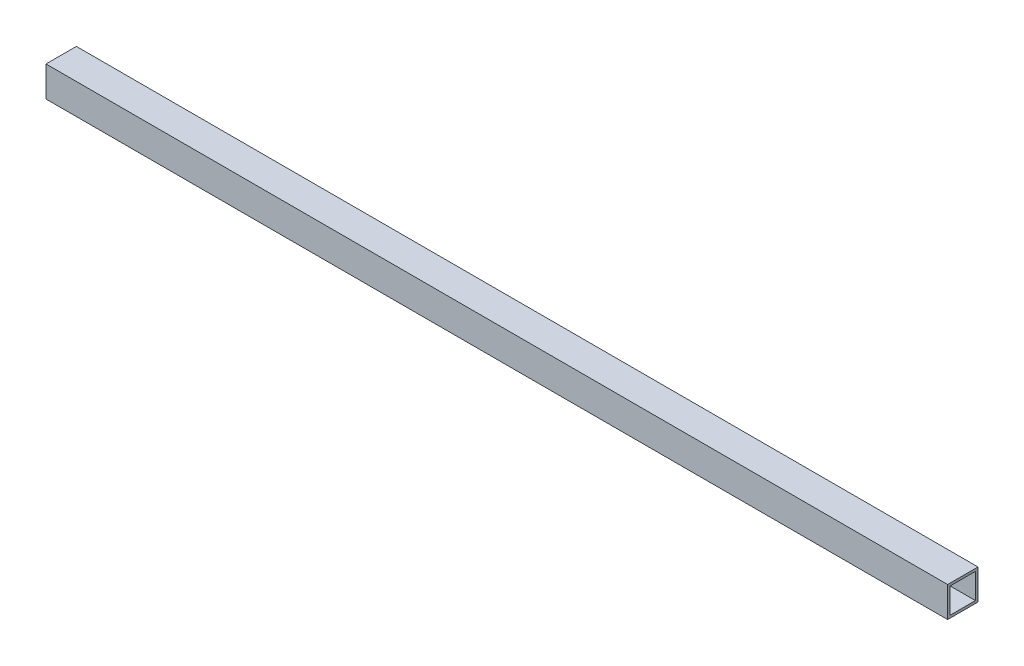
ISO-10303-21;
HEADER;
FILE_DESCRIPTION(('STEP AP214'),'2;1');
FILE_NAME('part.step','',(''),(''),'','','');
FILE_SCHEMA(('AUTOMOTIVE_DESIGN { 1 0 10303 214 1 1 1 1 }'));
ENDSEC;
DATA;
#1=APPLICATION_CONTEXT('core data for automotive mechanical design processes');
#2=APPLICATION_PROTOCOL_DEFINITION('international standard','automotive_design',2000,#1);
#3=PRODUCT_CONTEXT('',#1,'mechanical');
#4=PRODUCT('Part','Part','',(#3));
#5=PRODUCT_RELATED_PRODUCT_CATEGORY('part','',(#4));
#6=PRODUCT_DEFINITION_FORMATION('','',#4);
#7=PRODUCT_DEFINITION_CONTEXT('part definition',#1,'design');
#8=PRODUCT_DEFINITION('design','',#6,#7);
#9=PRODUCT_DEFINITION_SHAPE('','',#8);
#10=(LENGTH_UNIT() NAMED_UNIT(*) SI_UNIT(.MILLI.,.METRE.));
#11=(NAMED_UNIT(*) PLANE_ANGLE_UNIT() SI_UNIT($,.RADIAN.));
#12=(NAMED_UNIT(*) SI_UNIT($,.STERADIAN.) SOLID_ANGLE_UNIT());
#13=UNCERTAINTY_MEASURE_WITH_UNIT(LENGTH_MEASURE(1.E-05),#10,'distance_accuracy_value','');
#14=(GEOMETRIC_REPRESENTATION_CONTEXT(3) GLOBAL_UNCERTAINTY_ASSIGNED_CONTEXT((#13)) GLOBAL_UNIT_ASSIGNED_CONTEXT((#10,
#11,#12)) REPRESENTATION_CONTEXT('',''));
#15=CARTESIAN_POINT('',(0.,0.,0.));
#16=DIRECTION('',(0.,0.,1.));
#17=DIRECTION('',(1.,0.,0.));
#18=AXIS2_PLACEMENT_3D('',#15,#16,#17);
#19=CARTESIAN_POINT('',(282.575,0.,0.));
#20=DIRECTION('',(-1.,0.,0.));
#21=DIRECTION('',(0.,0.,1.));
#22=AXIS2_PLACEMENT_3D('',#19,#20,#21);
#23=PLANE('',#22);
#24=DIRECTION('',(0.,-1.,0.));
#25=VECTOR('',#24,1.);
#26=CARTESIAN_POINT('',(282.575,9.525,9.525));
#27=LINE('',#26,#25);
#28=CARTESIAN_POINT('',(282.575,9.525,9.525));
#29=VERTEX_POINT('',#28);
#30=CARTESIAN_POINT('',(282.575,-9.525,9.525));
#31=VERTEX_POINT('',#30);
#32=EDGE_CURVE('E138',#29,#31,#27,.T.);
#33=ORIENTED_EDGE('',*,*,#32,.T.);
#34=DIRECTION('',(0.,0.,-1.));
#35=VECTOR('',#34,1.);
#36=CARTESIAN_POINT('',(282.575,-9.525,-9.525));
#37=LINE('',#36,#35);
#38=CARTESIAN_POINT('',(282.575,-9.525,-9.525));
#39=VERTEX_POINT('',#38);
#40=EDGE_CURVE('E141',#31,#39,#37,.T.);
#41=ORIENTED_EDGE('',*,*,#40,.T.);
#42=DIRECTION('',(0.,1.,0.));
#43=VECTOR('',#42,1.);
#44=CARTESIAN_POINT('',(282.575,9.525,-9.525));
#45=LINE('',#44,#43);
#46=CARTESIAN_POINT('',(282.575,9.525,-9.525));
#47=VERTEX_POINT('',#46);
#48=EDGE_CURVE('E144',#39,#47,#45,.T.);
#49=ORIENTED_EDGE('',*,*,#48,.T.);
#50=DIRECTION('',(0.,0.,1.));
#51=VECTOR('',#50,1.);
#52=CARTESIAN_POINT('',(282.575,9.525,-9.525));
#53=LINE('',#52,#51);
#54=EDGE_CURVE('E146',#47,#29,#53,.T.);
#55=ORIENTED_EDGE('',*,*,#54,.T.);
#56=EDGE_LOOP('',(#33,#41,#49,#55));
#57=FACE_BOUND('',#56,.T.);
#58=DIRECTION('',(0.,0.,1.));
#59=VECTOR('',#58,1.);
#60=CARTESIAN_POINT('',(282.575,7.9375,-7.9375));
#61=LINE('',#60,#59);
#62=CARTESIAN_POINT('',(282.575,7.9375,-7.9375));
#63=VERTEX_POINT('',#62);
#64=CARTESIAN_POINT('',(282.575,7.9375,7.9375));
#65=VERTEX_POINT('',#64);
#66=EDGE_CURVE('E102',#63,#65,#61,.T.);
#67=ORIENTED_EDGE('',*,*,#66,.F.);
#68=DIRECTION('',(0.,1.,0.));
#69=VECTOR('',#68,1.);
#70=CARTESIAN_POINT('',(282.575,7.9375,-7.9375));
#71=LINE('',#70,#69);
#72=CARTESIAN_POINT('',(282.575,-7.9375,-7.9375));
#73=VERTEX_POINT('',#72);
#74=EDGE_CURVE('E124',#73,#63,#71,.T.);
#75=ORIENTED_EDGE('',*,*,#74,.F.);
#76=DIRECTION('',(0.,0.,-1.));
#77=VECTOR('',#76,1.);
#78=CARTESIAN_POINT('',(282.575,-7.9375,-7.9375));
#79=LINE('',#78,#77);
#80=CARTESIAN_POINT('',(282.575,-7.9375,7.93749999999999));
#81=VERTEX_POINT('',#80);
#82=EDGE_CURVE('E122',#81,#73,#79,.T.);
#83=ORIENTED_EDGE('',*,*,#82,.F.);
#84=DIRECTION('',(0.,-1.,0.));
#85=VECTOR('',#84,1.);
#86=CARTESIAN_POINT('',(282.575,7.9375,7.9375));
#87=LINE('',#86,#85);
#88=EDGE_CURVE('E110',#65,#81,#87,.T.);
#89=ORIENTED_EDGE('',*,*,#88,.F.);
#90=EDGE_LOOP('',(#67,#75,#83,#89));
#91=FACE_BOUND('',#90,.T.);
#92=ADVANCED_FACE('F37',(#57,#91),#23,.F.);
#93=CARTESIAN_POINT('',(-282.575,0.,0.));
#94=DIRECTION('',(-1.,0.,0.));
#95=DIRECTION('',(0.,0.,1.));
#96=AXIS2_PLACEMENT_3D('',#93,#94,#95);
#97=PLANE('',#96);
#98=DIRECTION('',(0.,-1.,0.));
#99=VECTOR('',#98,1.);
#100=CARTESIAN_POINT('',(-282.575,9.525,9.525));
#101=LINE('',#100,#99);
#102=CARTESIAN_POINT('',(-282.575,9.525,9.525));
#103=VERTEX_POINT('',#102);
#104=CARTESIAN_POINT('',(-282.575,-9.525,9.525));
#105=VERTEX_POINT('',#104);
#106=EDGE_CURVE('E118',#103,#105,#101,.T.);
#107=ORIENTED_EDGE('',*,*,#106,.F.);
#108=DIRECTION('',(0.,0.,1.));
#109=VECTOR('',#108,1.);
#110=CARTESIAN_POINT('',(-282.575,9.525,-9.525));
#111=LINE('',#110,#109);
#112=CARTESIAN_POINT('',(-282.575,9.525,-9.525));
#113=VERTEX_POINT('',#112);
#114=EDGE_CURVE('E142',#113,#103,#111,.T.);
#115=ORIENTED_EDGE('',*,*,#114,.F.);
#116=DIRECTION('',(0.,1.,0.));
#117=VECTOR('',#116,1.);
#118=CARTESIAN_POINT('',(-282.575,9.525,-9.525));
#119=LINE('',#118,#117);
#120=CARTESIAN_POINT('',(-282.575,-9.525,-9.525));
#121=VERTEX_POINT('',#120);
#122=EDGE_CURVE('E153',#121,#113,#119,.T.);
#123=ORIENTED_EDGE('',*,*,#122,.F.);
#124=DIRECTION('',(0.,0.,-1.));
#125=VECTOR('',#124,1.);
#126=CARTESIAN_POINT('',(-282.575,-9.525,-9.525));
#127=LINE('',#126,#125);
#128=EDGE_CURVE('E151',#105,#121,#127,.T.);
#129=ORIENTED_EDGE('',*,*,#128,.F.);
#130=EDGE_LOOP('',(#107,#115,#123,#129));
#131=FACE_BOUND('',#130,.T.);
#132=DIRECTION('',(0.,1.,0.));
#133=VECTOR('',#132,1.);
#134=CARTESIAN_POINT('',(-282.575,7.9375,-7.9375));
#135=LINE('',#134,#133);
#136=CARTESIAN_POINT('',(-282.575,-7.9375,-7.9375));
#137=VERTEX_POINT('',#136);
#138=CARTESIAN_POINT('',(-282.575,7.9375,-7.9375));
#139=VERTEX_POINT('',#138);
#140=EDGE_CURVE('E111',#137,#139,#135,.T.);
#141=ORIENTED_EDGE('',*,*,#140,.T.);
#142=DIRECTION('',(0.,0.,1.));
#143=VECTOR('',#142,1.);
#144=CARTESIAN_POINT('',(-282.575,7.9375,-7.9375));
#145=LINE('',#144,#143);
#146=CARTESIAN_POINT('',(-282.575,7.9375,7.9375));
#147=VERTEX_POINT('',#146);
#148=EDGE_CURVE('E60',#139,#147,#145,.T.);
#149=ORIENTED_EDGE('',*,*,#148,.T.);
#150=DIRECTION('',(0.,-1.,0.));
#151=VECTOR('',#150,1.);
#152=CARTESIAN_POINT('',(-282.575,7.9375,7.9375));
#153=LINE('',#152,#151);
#154=CARTESIAN_POINT('',(-282.575,-7.9375,7.93749999999999));
#155=VERTEX_POINT('',#154);
#156=EDGE_CURVE('E117',#147,#155,#153,.T.);
#157=ORIENTED_EDGE('',*,*,#156,.T.);
#158=DIRECTION('',(0.,0.,-1.));
#159=VECTOR('',#158,1.);
#160=CARTESIAN_POINT('',(-282.575,-7.9375,-7.9375));
#161=LINE('',#160,#159);
#162=EDGE_CURVE('E130',#155,#137,#161,.T.);
#163=ORIENTED_EDGE('',*,*,#162,.T.);
#164=EDGE_LOOP('',(#141,#149,#157,#163));
#165=FACE_BOUND('',#164,.T.);
#166=ADVANCED_FACE('F171',(#131,#165),#97,.T.);
#167=CARTESIAN_POINT('',(282.575,9.525,9.525));
#168=DIRECTION('',(0.,0.,-1.));
#169=DIRECTION('',(-1.,0.,0.));
#170=AXIS2_PLACEMENT_3D('',#167,#168,#169);
#171=PLANE('',#170);
#172=ORIENTED_EDGE('',*,*,#106,.T.);
#173=DIRECTION('',(-1.,0.,0.));
#174=VECTOR('',#173,1.);
#175=CARTESIAN_POINT('',(282.575,-9.525,9.525));
#176=LINE('',#175,#174);
#177=EDGE_CURVE('E11',#31,#105,#176,.T.);
#178=ORIENTED_EDGE('',*,*,#177,.F.);
#179=ORIENTED_EDGE('',*,*,#32,.F.);
#180=DIRECTION('',(-1.,0.,0.));
#181=VECTOR('',#180,1.);
#182=CARTESIAN_POINT('',(282.575,9.525,9.525));
#183=LINE('',#182,#181);
#184=EDGE_CURVE('E148',#29,#103,#183,.T.);
#185=ORIENTED_EDGE('',*,*,#184,.T.);
#186=EDGE_LOOP('',(#172,#178,#179,#185));
#187=FACE_BOUND('',#186,.T.);
#188=ADVANCED_FACE('F39',(#187),#171,.F.);
#189=CARTESIAN_POINT('',(282.575,-9.525,-9.525));
#190=DIRECTION('',(0.,1.,0.));
#191=DIRECTION('',(0.,0.,1.));
#192=AXIS2_PLACEMENT_3D('',#189,#190,#191);
#193=PLANE('',#192);
#194=ORIENTED_EDGE('',*,*,#128,.T.);
#195=DIRECTION('',(-1.,0.,0.));
#196=VECTOR('',#195,1.);
#197=CARTESIAN_POINT('',(282.575,-9.525,-9.525));
#198=LINE('',#197,#196);
#199=EDGE_CURVE('E45',#39,#121,#198,.T.);
#200=ORIENTED_EDGE('',*,*,#199,.F.);
#201=ORIENTED_EDGE('',*,*,#40,.F.);
#202=ORIENTED_EDGE('',*,*,#177,.T.);
#203=EDGE_LOOP('',(#194,#200,#201,#202));
#204=FACE_BOUND('',#203,.T.);
#205=ADVANCED_FACE('F181',(#204),#193,.F.);
#206=CARTESIAN_POINT('',(282.575,9.525,-9.525));
#207=DIRECTION('',(0.,0.,1.));
#208=DIRECTION('',(0.,-1.,0.));
#209=AXIS2_PLACEMENT_3D('',#206,#207,#208);
#210=PLANE('',#209);
#211=ORIENTED_EDGE('',*,*,#122,.T.);
#212=DIRECTION('',(-1.,0.,0.));
#213=VECTOR('',#212,1.);
#214=CARTESIAN_POINT('',(282.575,9.525,-9.525));
#215=LINE('',#214,#213);
#216=EDGE_CURVE('E158',#47,#113,#215,.T.);
#217=ORIENTED_EDGE('',*,*,#216,.F.);
#218=ORIENTED_EDGE('',*,*,#48,.F.);
#219=ORIENTED_EDGE('',*,*,#199,.T.);
#220=EDGE_LOOP('',(#211,#217,#218,#219));
#221=FACE_BOUND('',#220,.T.);
#222=ADVANCED_FACE('F165',(#221),#210,.F.);
#223=CARTESIAN_POINT('',(282.575,9.525,-9.525));
#224=DIRECTION('',(0.,-1.,0.));
#225=DIRECTION('',(0.,0.,-1.));
#226=AXIS2_PLACEMENT_3D('',#223,#224,#225);
#227=PLANE('',#226);
#228=ORIENTED_EDGE('',*,*,#114,.T.);
#229=ORIENTED_EDGE('',*,*,#184,.F.);
#230=ORIENTED_EDGE('',*,*,#54,.F.);
#231=ORIENTED_EDGE('',*,*,#216,.T.);
#232=EDGE_LOOP('',(#228,#229,#230,#231));
#233=FACE_BOUND('',#232,.T.);
#234=ADVANCED_FACE('F175',(#233),#227,.F.);
#235=CARTESIAN_POINT('',(282.575,7.9375,-7.9375));
#236=DIRECTION('',(0.,-1.,0.));
#237=DIRECTION('',(0.,0.,-1.));
#238=AXIS2_PLACEMENT_3D('',#235,#236,#237);
#239=PLANE('',#238);
#240=ORIENTED_EDGE('',*,*,#148,.F.);
#241=DIRECTION('',(-1.,0.,0.));
#242=VECTOR('',#241,1.);
#243=CARTESIAN_POINT('',(282.575,7.9375,-7.9375));
#244=LINE('',#243,#242);
#245=EDGE_CURVE('E106',#63,#139,#244,.T.);
#246=ORIENTED_EDGE('',*,*,#245,.F.);
#247=ORIENTED_EDGE('',*,*,#66,.T.);
#248=DIRECTION('',(-1.,0.,0.));
#249=VECTOR('',#248,1.);
#250=CARTESIAN_POINT('',(282.575,7.9375,7.9375));
#251=LINE('',#250,#249);
#252=EDGE_CURVE('E105',#65,#147,#251,.T.);
#253=ORIENTED_EDGE('',*,*,#252,.T.);
#254=EDGE_LOOP('',(#240,#246,#247,#253));
#255=FACE_BOUND('',#254,.T.);
#256=ADVANCED_FACE('F104',(#255),#239,.T.);
#257=CARTESIAN_POINT('',(282.575,7.9375,7.9375));
#258=DIRECTION('',(0.,0.,-1.));
#259=DIRECTION('',(0.,1.,0.));
#260=AXIS2_PLACEMENT_3D('',#257,#258,#259);
#261=PLANE('',#260);
#262=ORIENTED_EDGE('',*,*,#156,.F.);
#263=ORIENTED_EDGE('',*,*,#252,.F.);
#264=ORIENTED_EDGE('',*,*,#88,.T.);
#265=DIRECTION('',(-1.,0.,0.));
#266=VECTOR('',#265,1.);
#267=CARTESIAN_POINT('',(282.575,-7.9375,7.93749999999999));
#268=LINE('',#267,#266);
#269=EDGE_CURVE('E119',#81,#155,#268,.T.);
#270=ORIENTED_EDGE('',*,*,#269,.T.);
#271=EDGE_LOOP('',(#262,#263,#264,#270));
#272=FACE_BOUND('',#271,.T.);
#273=ADVANCED_FACE('F114',(#272),#261,.T.);
#274=CARTESIAN_POINT('',(282.575,-7.9375,-7.9375));
#275=DIRECTION('',(0.,1.,0.));
#276=DIRECTION('',(0.,0.,1.));
#277=AXIS2_PLACEMENT_3D('',#274,#275,#276);
#278=PLANE('',#277);
#279=ORIENTED_EDGE('',*,*,#162,.F.);
#280=ORIENTED_EDGE('',*,*,#269,.F.);
#281=ORIENTED_EDGE('',*,*,#82,.T.);
#282=DIRECTION('',(-1.,0.,0.));
#283=VECTOR('',#282,1.);
#284=CARTESIAN_POINT('',(282.575,-7.9375,-7.9375));
#285=LINE('',#284,#283);
#286=EDGE_CURVE('E52',#73,#137,#285,.T.);
#287=ORIENTED_EDGE('',*,*,#286,.T.);
#288=EDGE_LOOP('',(#279,#280,#281,#287));
#289=FACE_BOUND('',#288,.T.);
#290=ADVANCED_FACE('F204',(#289),#278,.T.);
#291=CARTESIAN_POINT('',(282.575,7.9375,-7.9375));
#292=DIRECTION('',(0.,0.,1.));
#293=DIRECTION('',(0.,-1.,0.));
#294=AXIS2_PLACEMENT_3D('',#291,#292,#293);
#295=PLANE('',#294);
#296=ORIENTED_EDGE('',*,*,#140,.F.);
#297=ORIENTED_EDGE('',*,*,#286,.F.);
#298=ORIENTED_EDGE('',*,*,#74,.T.);
#299=ORIENTED_EDGE('',*,*,#245,.T.);
#300=EDGE_LOOP('',(#296,#297,#298,#299));
#301=FACE_BOUND('',#300,.T.);
#302=ADVANCED_FACE('F208',(#301),#295,.T.);
#303=CLOSED_SHELL('',(#92,#166,#188,#205,#222,#234,#256,#273,#290,#302));
#304=MANIFOLD_SOLID_BREP('B2',#303);
#305=ADVANCED_BREP_SHAPE_REPRESENTATION('',(#18,#304),#14);
#306=SHAPE_DEFINITION_REPRESENTATION(#9,#305);
ENDSEC;
END-ISO-10303-21;
